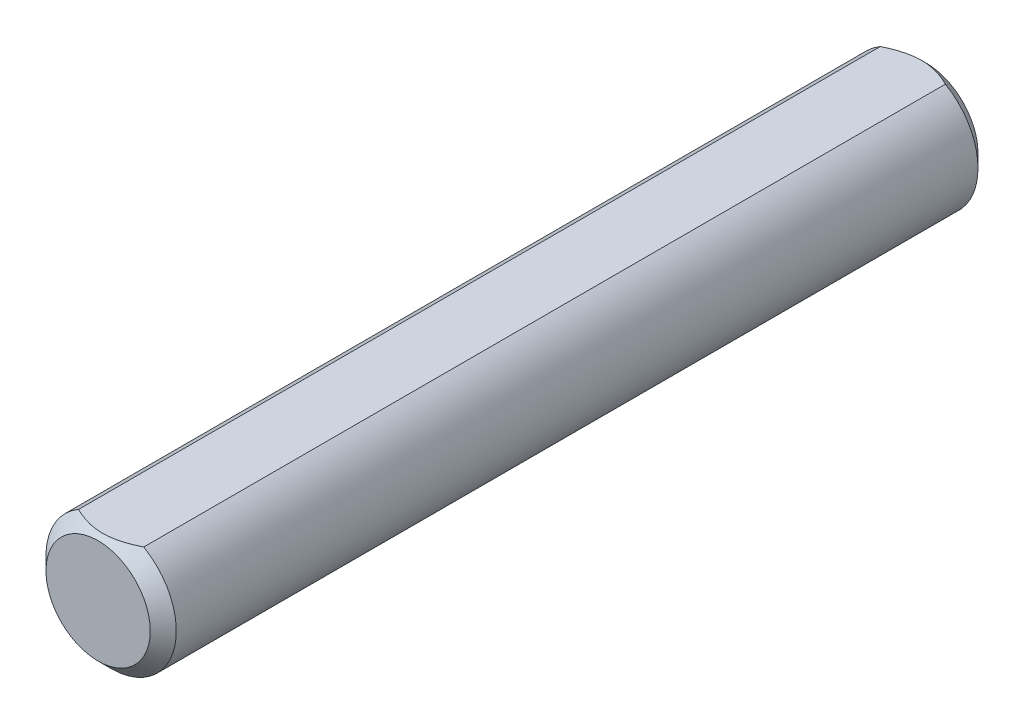
ISO-10303-21;
HEADER;
FILE_DESCRIPTION(('STEP AP214'),'2;1');
FILE_NAME('part.step','',(''),(''),'','','');
FILE_SCHEMA(('AUTOMOTIVE_DESIGN { 1 0 10303 214 1 1 1 1 }'));
ENDSEC;
DATA;
#1=APPLICATION_CONTEXT('core data for automotive mechanical design processes');
#2=APPLICATION_PROTOCOL_DEFINITION('international standard','automotive_design',2000,#1);
#3=PRODUCT_CONTEXT('',#1,'mechanical');
#4=PRODUCT('Part','Part','',(#3));
#5=PRODUCT_RELATED_PRODUCT_CATEGORY('part','',(#4));
#6=PRODUCT_DEFINITION_FORMATION('','',#4);
#7=PRODUCT_DEFINITION_CONTEXT('part definition',#1,'design');
#8=PRODUCT_DEFINITION('design','',#6,#7);
#9=PRODUCT_DEFINITION_SHAPE('','',#8);
#10=(LENGTH_UNIT() NAMED_UNIT(*) SI_UNIT(.MILLI.,.METRE.));
#11=(NAMED_UNIT(*) PLANE_ANGLE_UNIT() SI_UNIT($,.RADIAN.));
#12=(NAMED_UNIT(*) SI_UNIT($,.STERADIAN.) SOLID_ANGLE_UNIT());
#13=UNCERTAINTY_MEASURE_WITH_UNIT(LENGTH_MEASURE(1.E-05),#10,'distance_accuracy_value','');
#14=(GEOMETRIC_REPRESENTATION_CONTEXT(3) GLOBAL_UNCERTAINTY_ASSIGNED_CONTEXT((#13)) GLOBAL_UNIT_ASSIGNED_CONTEXT((#10,
#11,#12)) REPRESENTATION_CONTEXT('',''));
#15=CARTESIAN_POINT('',(0.,0.,0.));
#16=DIRECTION('',(0.,0.,1.));
#17=DIRECTION('',(1.,0.,0.));
#18=AXIS2_PLACEMENT_3D('',#15,#16,#17);
#19=CARTESIAN_POINT('',(0.,0.,19.05));
#20=DIRECTION('',(0.,0.,-1.));
#21=DIRECTION('',(-1.,0.,0.));
#22=AXIS2_PLACEMENT_3D('',#19,#20,#21);
#23=CYLINDRICAL_SURFACE('',#22,3.);
#24=CARTESIAN_POINT('',(0.,0.,18.45));
#25=DIRECTION('',(0.,0.,1.));
#26=DIRECTION('',(1.,0.,0.));
#27=AXIS2_PLACEMENT_3D('',#24,#25,#26);
#28=CIRCLE('',#27,3.);
#29=CARTESIAN_POINT('',(1.5,2.59807621135332,18.45));
#30=VERTEX_POINT('',#29);
#31=CARTESIAN_POINT('',(-1.5,2.59807621135332,18.45));
#32=VERTEX_POINT('',#31);
#33=EDGE_CURVE('E75',#30,#32,#28,.F.);
#34=ORIENTED_EDGE('',*,*,#33,.T.);
#35=DIRECTION('',(0.,0.,1.));
#36=VECTOR('',#35,1.);
#37=CARTESIAN_POINT('',(-1.5,2.59807621135332,-19.05));
#38=LINE('',#37,#36);
#39=CARTESIAN_POINT('',(-1.5,2.59807621135332,-18.45));
#40=VERTEX_POINT('',#39);
#41=EDGE_CURVE('E53',#40,#32,#38,.T.);
#42=ORIENTED_EDGE('',*,*,#41,.F.);
#43=CARTESIAN_POINT('',(0.,0.,-18.45));
#44=DIRECTION('',(0.,0.,1.));
#45=DIRECTION('',(1.,0.,0.));
#46=AXIS2_PLACEMENT_3D('',#43,#44,#45);
#47=CIRCLE('',#46,3.);
#48=CARTESIAN_POINT('',(1.5,2.59807621135332,-18.45));
#49=VERTEX_POINT('',#48);
#50=EDGE_CURVE('E74',#40,#49,#47,.T.);
#51=ORIENTED_EDGE('',*,*,#50,.T.);
#52=DIRECTION('',(0.,0.,1.));
#53=VECTOR('',#52,1.);
#54=CARTESIAN_POINT('',(1.5,2.59807621135332,-19.05));
#55=LINE('',#54,#53);
#56=EDGE_CURVE('E63',#49,#30,#55,.T.);
#57=ORIENTED_EDGE('',*,*,#56,.T.);
#58=EDGE_LOOP('',(#34,#42,#51,#57));
#59=FACE_BOUND('',#58,.T.);
#60=ADVANCED_FACE('F33',(#59),#23,.T.);
#61=CARTESIAN_POINT('',(0.,0.,19.05));
#62=DIRECTION('',(0.,0.,1.));
#63=DIRECTION('',(1.,0.,0.));
#64=AXIS2_PLACEMENT_3D('',#61,#62,#63);
#65=PLANE('',#64);
#66=CARTESIAN_POINT('',(0.,0.,19.05));
#67=DIRECTION('',(0.,0.,1.));
#68=DIRECTION('',(1.,0.,0.));
#69=AXIS2_PLACEMENT_3D('',#66,#67,#68);
#70=CIRCLE('',#69,2.40000000000001);
#71=CARTESIAN_POINT('',(2.40000000000001,0.,19.05));
#72=VERTEX_POINT('',#71);
#73=EDGE_CURVE('E47',#72,#72,#70,.T.);
#74=ORIENTED_EDGE('',*,*,#73,.T.);
#75=EDGE_LOOP('',(#74));
#76=FACE_BOUND('',#75,.T.);
#77=ADVANCED_FACE('F85',(#76),#65,.T.);
#78=CARTESIAN_POINT('',(0.,0.,-19.05));
#79=DIRECTION('',(0.,0.,1.));
#80=DIRECTION('',(1.,0.,0.));
#81=AXIS2_PLACEMENT_3D('',#78,#79,#80);
#82=PLANE('',#81);
#83=CARTESIAN_POINT('',(0.,0.,-19.05));
#84=DIRECTION('',(0.,0.,1.));
#85=DIRECTION('',(1.,0.,0.));
#86=AXIS2_PLACEMENT_3D('',#83,#84,#85);
#87=CIRCLE('',#86,2.39999999999996);
#88=CARTESIAN_POINT('',(2.39999999999996,0.,-19.05));
#89=VERTEX_POINT('',#88);
#90=EDGE_CURVE('E77',#89,#89,#87,.F.);
#91=ORIENTED_EDGE('',*,*,#90,.T.);
#92=EDGE_LOOP('',(#91));
#93=FACE_BOUND('',#92,.T.);
#94=ADVANCED_FACE('F93',(#93),#82,.F.);
#95=CARTESIAN_POINT('',(0.,0.,-18.45));
#96=DIRECTION('',(0.,0.,1.));
#97=DIRECTION('',(1.,0.,0.));
#98=AXIS2_PLACEMENT_3D('',#95,#96,#97);
#99=CONICAL_SURFACE('',#98,3.,0.785398163397453);
#100=CARTESIAN_POINT('',(-3.05098710447618,2.59807621135332,-17.4426913880161));
#101=CARTESIAN_POINT('',(-2.97696046818996,2.59807621135332,-17.4990392357915));
#102=CARTESIAN_POINT('',(-2.902526075445,2.59807621135332,-17.5548599830158));
#103=CARTESIAN_POINT('',(-2.75267839907545,2.59807621135332,-17.6652091820016));
#104=CARTESIAN_POINT('',(-2.67726488037443,2.59807621135332,-17.7197373141976));
#105=CARTESIAN_POINT('',(-2.52474390097083,2.59807621135332,-17.8276512262725));
#106=CARTESIAN_POINT('',(-2.44762784853948,2.59807621135332,-17.8810249034997));
#107=CARTESIAN_POINT('',(-2.29209743265036,2.59807621135332,-17.9858395411033));
#108=CARTESIAN_POINT('',(-2.21368316040316,2.59807621135332,-18.0372806364364));
#109=CARTESIAN_POINT('',(-2.05059635704468,2.59807621135332,-18.1408099570069));
#110=CARTESIAN_POINT('',(-1.96583053723646,2.59807621135332,-18.1927519704002));
#111=CARTESIAN_POINT('',(-1.79433925680652,2.59807621135332,-18.2932884975098));
#112=CARTESIAN_POINT('',(-1.70761405536032,2.59807621135332,-18.3418834505526));
#113=CARTESIAN_POINT('',(-1.53216151529697,2.59807621135332,-18.4347069024108));
#114=CARTESIAN_POINT('',(-1.44344070162986,2.59807621135332,-18.4789476379622));
#115=CARTESIAN_POINT('',(-1.26354053453952,2.59807621135332,-18.5620637625266));
#116=CARTESIAN_POINT('',(-1.17236233807282,2.59807621135332,-18.6009416254433));
#117=CARTESIAN_POINT('',(-0.995572372542496,2.59807621135332,-18.6687934839973));
#118=CARTESIAN_POINT('',(-0.910182449375083,2.59807621135332,-18.6983395691086));
#119=CARTESIAN_POINT('',(-0.73729486786875,2.59807621135332,-18.7505888384413));
#120=CARTESIAN_POINT('',(-0.649797069712867,2.59807621135332,-18.7732915673807));
#121=CARTESIAN_POINT('',(-0.47470056499166,2.59807621135332,-18.8102724007947));
#122=CARTESIAN_POINT('',(-0.387133648957553,2.59807621135332,-18.8246985399202));
#123=CARTESIAN_POINT('',(-0.210998107734099,2.59807621135332,-18.8448367011301));
#124=CARTESIAN_POINT('',(-0.122429672539234,2.59807621135332,-18.8505503489897));
#125=CARTESIAN_POINT('',(0.0513408717181315,2.59807621135332,-18.8528121120458));
#126=CARTESIAN_POINT('',(0.136538496899885,2.59807621135332,-18.8497115775381));
#127=CARTESIAN_POINT('',(0.306232009675675,2.59807621135332,-18.8353056113044));
#128=CARTESIAN_POINT('',(0.390727830138782,2.59807621135332,-18.8239994036045));
#129=CARTESIAN_POINT('',(0.559838802542441,2.59807621135332,-18.7936171875932));
#130=CARTESIAN_POINT('',(0.644429458940815,2.59807621135332,-18.7744068474096));
#131=CARTESIAN_POINT('',(0.811751219493388,2.59807621135332,-18.7292553051533));
#132=CARTESIAN_POINT('',(0.894482457721697,2.59807621135332,-18.7033145900799));
#133=CARTESIAN_POINT('',(1.15232714343746,2.59807621135332,-18.6126420304154));
#134=CARTESIAN_POINT('',(1.32386073082836,2.59807621135332,-18.5376939710894));
#135=CARTESIAN_POINT('',(1.57489029439241,2.59807621135332,-18.4127281750164));
#136=CARTESIAN_POINT('',(1.65767705560649,2.59807621135332,-18.3688844042114));
#137=CARTESIAN_POINT('',(1.82137276975374,2.59807621135332,-18.2778134530088));
#138=CARTESIAN_POINT('',(1.90228205390987,2.59807621135332,-18.2305868755044));
#139=CARTESIAN_POINT('',(2.05847418222748,2.59807621135332,-18.1358398519427));
#140=CARTESIAN_POINT('',(2.1338371393588,2.59807621135332,-18.0884499770452));
#141=CARTESIAN_POINT('',(2.28327041234649,2.59807621135332,-17.9916644577283));
#142=CARTESIAN_POINT('',(2.35734063012458,2.59807621135332,-17.9422686620603));
#143=CARTESIAN_POINT('',(2.50375735992412,2.59807621135332,-17.8422360236743));
#144=CARTESIAN_POINT('',(2.57611296362803,2.59807621135332,-17.7916124331721));
#145=CARTESIAN_POINT('',(2.71983349577173,2.59807621135332,-17.6890177228506));
#146=CARTESIAN_POINT('',(2.79119869152066,2.59807621135332,-17.6370469779297));
#147=CARTESIAN_POINT('',(2.86214901703589,2.59807621135332,-17.5845249974007));
#148=B_SPLINE_CURVE_WITH_KNOTS('',3,(#100,#101,#102,#103,#104,#105,#106,#107,#108,#109,#110,
#111,#112,#113,#114,#115,#116,#117,#118,#119,#120,#121,#122,#123,#124,#125,#126,#127,#128,#129,
#130,#131,#132,#133,#134,#135,#136,#137,#138,#139,#140,#141,#142,#143,#144,#145,#146,#147),
.UNSPECIFIED.,.F.,.F.,(4,2,2,2,2,2,2,2,2,2,2,2,2,2,2,2,2,2,2,2,2,2,2,4),(0.,0.279102471752321,
0.558273239526411,0.839603973187033,1.12091502424317,1.41909718648587,1.71724013522216,
2.01451973191957,2.31166173103157,2.58249698919339,2.85335026179998,3.11919456625156,
3.38498925734197,3.64033914608024,3.89571318526476,4.15561942303367,4.41550685963972,
4.97534240542973,5.25635904075952,5.53732571653672,5.80436715203983,6.07142876028594,
6.33633255241061,6.60116339978523),.UNSPECIFIED.);
#149=EDGE_CURVE('E58',#49,#40,#148,.F.);
#150=ORIENTED_EDGE('',*,*,#149,.F.);
#151=ORIENTED_EDGE('',*,*,#50,.F.);
#152=EDGE_LOOP('',(#150,#151));
#153=FACE_BOUND('',#152,.T.);
#154=ORIENTED_EDGE('',*,*,#90,.F.);
#155=EDGE_LOOP('',(#154));
#156=FACE_BOUND('',#155,.T.);
#157=ADVANCED_FACE('F72',(#153,#156),#99,.T.);
#158=CARTESIAN_POINT('',(0.,0.,19.05));
#159=DIRECTION('',(0.,0.,-1.));
#160=DIRECTION('',(-1.,0.,0.));
#161=AXIS2_PLACEMENT_3D('',#158,#159,#160);
#162=CONICAL_SURFACE('',#161,2.40000000000001,0.785398163397447);
#163=CARTESIAN_POINT('',(-3.05098710447619,2.59807621135332,17.4426913880162));
#164=CARTESIAN_POINT('',(-2.97696046818997,2.59807621135332,17.4990392357915));
#165=CARTESIAN_POINT('',(-2.90252607544501,2.59807621135332,17.5548599830158));
#166=CARTESIAN_POINT('',(-2.75267839907546,2.59807621135332,17.6652091820016));
#167=CARTESIAN_POINT('',(-2.67726488037444,2.59807621135332,17.7197373141976));
#168=CARTESIAN_POINT('',(-2.52474390097083,2.59807621135332,17.8276512262725));
#169=CARTESIAN_POINT('',(-2.44762784853948,2.59807621135332,17.8810249034997));
#170=CARTESIAN_POINT('',(-2.29209743265037,2.59807621135332,17.9858395411034));
#171=CARTESIAN_POINT('',(-2.21368316040316,2.59807621135332,18.0372806364364));
#172=CARTESIAN_POINT('',(-2.05059635704468,2.59807621135332,18.1408099570069));
#173=CARTESIAN_POINT('',(-1.96583053723647,2.59807621135332,18.1927519704002));
#174=CARTESIAN_POINT('',(-1.79433925680653,2.59807621135332,18.2932884975098));
#175=CARTESIAN_POINT('',(-1.70761405536033,2.59807621135332,18.3418834505527));
#176=CARTESIAN_POINT('',(-1.53216151529697,2.59807621135332,18.4347069024108));
#177=CARTESIAN_POINT('',(-1.44344070162986,2.59807621135332,18.4789476379623));
#178=CARTESIAN_POINT('',(-1.26354053453953,2.59807621135332,18.5620637625266));
#179=CARTESIAN_POINT('',(-1.17236233807283,2.59807621135332,18.6009416254434));
#180=CARTESIAN_POINT('',(-0.995572372542507,2.59807621135332,18.6687934839973));
#181=CARTESIAN_POINT('',(-0.910182449375094,2.59807621135332,18.6983395691086));
#182=CARTESIAN_POINT('',(-0.737294867868762,2.59807621135332,18.7505888384414));
#183=CARTESIAN_POINT('',(-0.64979706971288,2.59807621135332,18.7732915673808));
#184=CARTESIAN_POINT('',(-0.474700564991674,2.59807621135332,18.8102724007948));
#185=CARTESIAN_POINT('',(-0.387133648957568,2.59807621135332,18.8246985399202));
#186=CARTESIAN_POINT('',(-0.210998107734115,2.59807621135332,18.8448367011302));
#187=CARTESIAN_POINT('',(-0.12242967253925,2.59807621135332,18.8505503489897));
#188=CARTESIAN_POINT('',(0.0513408717181147,2.59807621135332,18.8528121120458));
#189=CARTESIAN_POINT('',(0.136538496899868,2.59807621135332,18.8497115775381));
#190=CARTESIAN_POINT('',(0.306232009675658,2.59807621135332,18.8353056113044));
#191=CARTESIAN_POINT('',(0.390727830138764,2.59807621135332,18.8239994036045));
#192=CARTESIAN_POINT('',(0.559838802542423,2.59807621135332,18.7936171875932));
#193=CARTESIAN_POINT('',(0.644429458940797,2.59807621135332,18.7744068474097));
#194=CARTESIAN_POINT('',(0.811751219493369,2.59807621135332,18.7292553051534));
#195=CARTESIAN_POINT('',(0.894482457721678,2.59807621135332,18.7033145900799));
#196=CARTESIAN_POINT('',(1.15232714343744,2.59807621135332,18.6126420304155));
#197=CARTESIAN_POINT('',(1.32386073082833,2.59807621135332,18.5376939710894));
#198=CARTESIAN_POINT('',(1.57489029439237,2.59807621135332,18.4127281750164));
#199=CARTESIAN_POINT('',(1.65767705560645,2.59807621135332,18.3688844042115));
#200=CARTESIAN_POINT('',(1.8213727697537,2.59807621135332,18.2778134530089));
#201=CARTESIAN_POINT('',(1.90228205390982,2.59807621135332,18.2305868755045));
#202=CARTESIAN_POINT('',(2.05847418222743,2.59807621135332,18.1358398519428));
#203=CARTESIAN_POINT('',(2.13383713935874,2.59807621135332,18.0884499770453));
#204=CARTESIAN_POINT('',(2.28327041234643,2.59807621135332,17.9916644577284));
#205=CARTESIAN_POINT('',(2.35734063012451,2.59807621135332,17.9422686620603));
#206=CARTESIAN_POINT('',(2.50375735992405,2.59807621135332,17.8422360236744));
#207=CARTESIAN_POINT('',(2.57611296362795,2.59807621135332,17.7916124331722));
#208=CARTESIAN_POINT('',(2.71983349577165,2.59807621135332,17.6890177228506));
#209=CARTESIAN_POINT('',(2.79119869152058,2.59807621135332,17.6370469779298));
#210=CARTESIAN_POINT('',(2.86214901703581,2.59807621135332,17.5845249974008));
#211=B_SPLINE_CURVE_WITH_KNOTS('',3,(#163,#164,#165,#166,#167,#168,#169,#170,#171,#172,#173,
#174,#175,#176,#177,#178,#179,#180,#181,#182,#183,#184,#185,#186,#187,#188,#189,#190,#191,#192,
#193,#194,#195,#196,#197,#198,#199,#200,#201,#202,#203,#204,#205,#206,#207,#208,#209,#210),
.UNSPECIFIED.,.F.,.F.,(4,2,2,2,2,2,2,2,2,2,2,2,2,2,2,2,2,2,2,2,2,2,2,4),(0.,0.279102471752323,
0.558273239526412,0.839603973187036,1.12091502424317,1.41909718648588,1.71724013522217,
2.01451973191957,2.31166173103158,2.58249698919339,2.85335026179999,3.11919456625156,
3.38498925734197,3.64033914608024,3.89571318526475,4.15561942303367,4.41550685963972,
4.97534240542971,5.25635904075949,5.53732571653668,5.80436715203978,6.07142876028587,
6.33633255241054,6.60116339978515),.UNSPECIFIED.);
#212=EDGE_CURVE('E11',#32,#30,#211,.T.);
#213=ORIENTED_EDGE('',*,*,#212,.F.);
#214=ORIENTED_EDGE('',*,*,#33,.F.);
#215=EDGE_LOOP('',(#213,#214));
#216=FACE_BOUND('',#215,.T.);
#217=ORIENTED_EDGE('',*,*,#73,.F.);
#218=EDGE_LOOP('',(#217));
#219=FACE_BOUND('',#218,.T.);
#220=ADVANCED_FACE('F35',(#216,#219),#162,.T.);
#221=CARTESIAN_POINT('',(-1.5,2.59807621135332,-19.05));
#222=DIRECTION('',(0.,-1.,0.));
#223=DIRECTION('',(0.,0.,-1.));
#224=AXIS2_PLACEMENT_3D('',#221,#222,#223);
#225=PLANE('',#224);
#226=ORIENTED_EDGE('',*,*,#149,.T.);
#227=ORIENTED_EDGE('',*,*,#41,.T.);
#228=ORIENTED_EDGE('',*,*,#212,.T.);
#229=ORIENTED_EDGE('',*,*,#56,.F.);
#230=EDGE_LOOP('',(#226,#227,#228,#229));
#231=FACE_BOUND('',#230,.T.);
#232=ADVANCED_FACE('F64',(#231),#225,.F.);
#233=CLOSED_SHELL('',(#60,#77,#94,#157,#220,#232));
#234=MANIFOLD_SOLID_BREP('B2',#233);
#235=ADVANCED_BREP_SHAPE_REPRESENTATION('',(#18,#234),#14);
#236=SHAPE_DEFINITION_REPRESENTATION(#9,#235);
ENDSEC;
END-ISO-10303-21;
